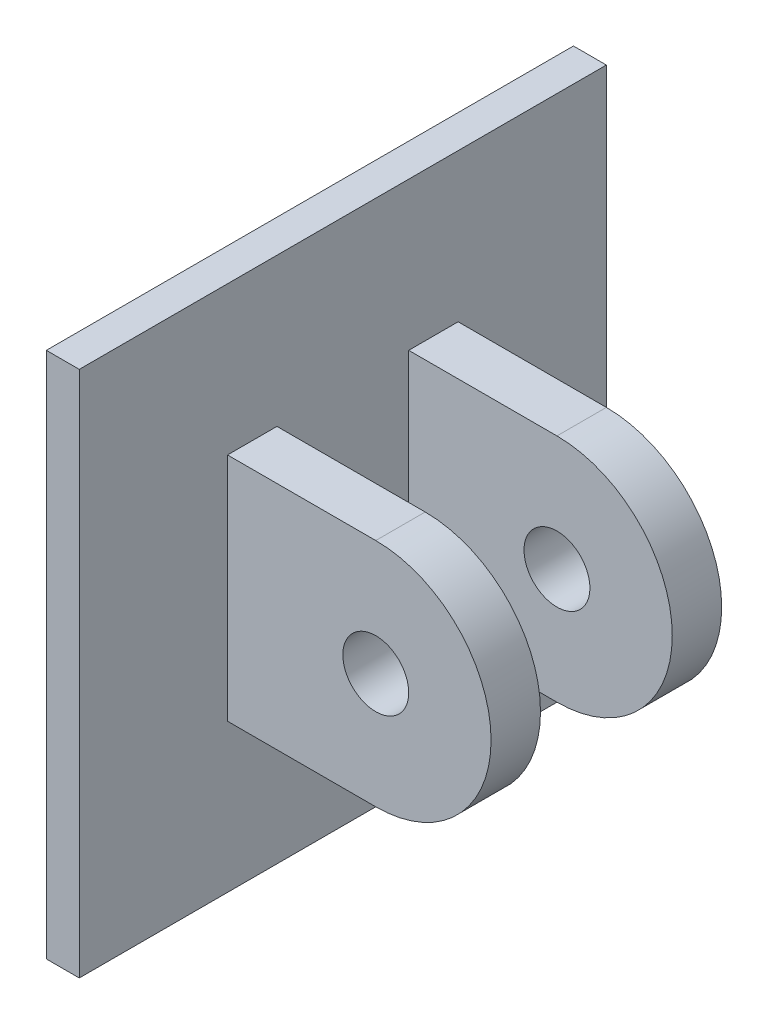
ISO-10303-21;
HEADER;
FILE_DESCRIPTION(('STEP AP214'),'2;1');
FILE_NAME('part.step','',(''),(''),'','','');
FILE_SCHEMA(('AUTOMOTIVE_DESIGN { 1 0 10303 214 1 1 1 1 }'));
ENDSEC;
DATA;
#1=APPLICATION_CONTEXT('core data for automotive mechanical design processes');
#2=APPLICATION_PROTOCOL_DEFINITION('international standard','automotive_design',2000,#1);
#3=PRODUCT_CONTEXT('',#1,'mechanical');
#4=PRODUCT('Part','Part','',(#3));
#5=PRODUCT_RELATED_PRODUCT_CATEGORY('part','',(#4));
#6=PRODUCT_DEFINITION_FORMATION('','',#4);
#7=PRODUCT_DEFINITION_CONTEXT('part definition',#1,'design');
#8=PRODUCT_DEFINITION('design','',#6,#7);
#9=PRODUCT_DEFINITION_SHAPE('','',#8);
#10=(LENGTH_UNIT() NAMED_UNIT(*) SI_UNIT(.MILLI.,.METRE.));
#11=(NAMED_UNIT(*) PLANE_ANGLE_UNIT() SI_UNIT($,.RADIAN.));
#12=(NAMED_UNIT(*) SI_UNIT($,.STERADIAN.) SOLID_ANGLE_UNIT());
#13=UNCERTAINTY_MEASURE_WITH_UNIT(LENGTH_MEASURE(1.E-05),#10,'distance_accuracy_value','');
#14=(GEOMETRIC_REPRESENTATION_CONTEXT(3) GLOBAL_UNCERTAINTY_ASSIGNED_CONTEXT((#13)) GLOBAL_UNIT_ASSIGNED_CONTEXT((#10,
#11,#12)) REPRESENTATION_CONTEXT('',''));
#15=CARTESIAN_POINT('',(0.,0.,0.));
#16=DIRECTION('',(0.,0.,1.));
#17=DIRECTION('',(1.,0.,0.));
#18=AXIS2_PLACEMENT_3D('',#15,#16,#17);
#19=CARTESIAN_POINT('',(57.15,22.225,-12.7));
#20=DIRECTION('',(0.,0.,-1.));
#21=DIRECTION('',(0.,1.,0.));
#22=AXIS2_PLACEMENT_3D('',#19,#20,#21);
#23=PLANE('',#22);
#24=CARTESIAN_POINT('',(34.925,0.,-12.7));
#25=DIRECTION('',(0.,0.,-1.));
#26=DIRECTION('',(0.,1.,0.));
#27=AXIS2_PLACEMENT_3D('',#24,#25,#26);
#28=CIRCLE('',#27,6.35);
#29=CARTESIAN_POINT('',(34.925,6.35,-12.7));
#30=VERTEX_POINT('',#29);
#31=EDGE_CURVE('E185',#30,#30,#28,.T.);
#32=ORIENTED_EDGE('',*,*,#31,.T.);
#33=EDGE_LOOP('',(#32));
#34=FACE_BOUND('',#33,.T.);
#35=DIRECTION('',(-1.,0.,0.));
#36=VECTOR('',#35,1.);
#37=CARTESIAN_POINT('',(57.15,-22.225,-12.7));
#38=LINE('',#37,#36);
#39=CARTESIAN_POINT('',(34.925,-22.225,-12.7));
#40=VERTEX_POINT('',#39);
#41=CARTESIAN_POINT('',(6.35,-22.225,-12.7));
#42=VERTEX_POINT('',#41);
#43=EDGE_CURVE('E191',#40,#42,#38,.T.);
#44=ORIENTED_EDGE('',*,*,#43,.F.);
#45=CARTESIAN_POINT('',(34.925,0.,-12.7));
#46=DIRECTION('',(0.,0.,-1.));
#47=DIRECTION('',(0.,1.,0.));
#48=AXIS2_PLACEMENT_3D('',#45,#46,#47);
#49=CIRCLE('',#48,22.225);
#50=CARTESIAN_POINT('',(34.925,22.225,-12.7));
#51=VERTEX_POINT('',#50);
#52=EDGE_CURVE('E182',#51,#40,#49,.T.);
#53=ORIENTED_EDGE('',*,*,#52,.F.);
#54=DIRECTION('',(-1.,0.,0.));
#55=VECTOR('',#54,1.);
#56=CARTESIAN_POINT('',(57.15,22.225,-12.7));
#57=LINE('',#56,#55);
#58=CARTESIAN_POINT('',(6.35,22.225,-12.7));
#59=VERTEX_POINT('',#58);
#60=EDGE_CURVE('E193',#51,#59,#57,.T.);
#61=ORIENTED_EDGE('',*,*,#60,.T.);
#62=DIRECTION('',(0.,-1.,0.));
#63=VECTOR('',#62,1.);
#64=CARTESIAN_POINT('',(6.35,22.225,-12.7));
#65=LINE('',#64,#63);
#66=EDGE_CURVE('E282',#59,#42,#65,.T.);
#67=ORIENTED_EDGE('',*,*,#66,.T.);
#68=EDGE_LOOP('',(#44,#53,#61,#67));
#69=FACE_BOUND('',#68,.T.);
#70=ADVANCED_FACE('F74',(#34,#69),#23,.F.);
#71=CARTESIAN_POINT('',(57.15,22.225,-22.225));
#72=DIRECTION('',(0.,0.,1.));
#73=DIRECTION('',(0.,-1.,0.));
#74=AXIS2_PLACEMENT_3D('',#71,#72,#73);
#75=PLANE('',#74);
#76=CARTESIAN_POINT('',(34.925,0.,-22.225));
#77=DIRECTION('',(0.,0.,-1.));
#78=DIRECTION('',(0.,1.,0.));
#79=AXIS2_PLACEMENT_3D('',#76,#77,#78);
#80=CIRCLE('',#79,6.35);
#81=CARTESIAN_POINT('',(34.925,6.35000000000001,-22.225));
#82=VERTEX_POINT('',#81);
#83=EDGE_CURVE('E459',#82,#82,#80,.T.);
#84=ORIENTED_EDGE('',*,*,#83,.F.);
#85=EDGE_LOOP('',(#84));
#86=FACE_BOUND('',#85,.T.);
#87=CARTESIAN_POINT('',(34.925,0.,-22.225));
#88=DIRECTION('',(0.,0.,-1.));
#89=DIRECTION('',(0.,1.,0.));
#90=AXIS2_PLACEMENT_3D('',#87,#88,#89);
#91=CIRCLE('',#90,22.225);
#92=CARTESIAN_POINT('',(34.925,22.225,-22.225));
#93=VERTEX_POINT('',#92);
#94=CARTESIAN_POINT('',(34.925,-22.225,-22.225));
#95=VERTEX_POINT('',#94);
#96=EDGE_CURVE('E166',#93,#95,#91,.T.);
#97=ORIENTED_EDGE('',*,*,#96,.T.);
#98=DIRECTION('',(-1.,0.,0.));
#99=VECTOR('',#98,1.);
#100=CARTESIAN_POINT('',(57.15,-22.225,-22.225));
#101=LINE('',#100,#99);
#102=CARTESIAN_POINT('',(6.35,-22.225,-22.225));
#103=VERTEX_POINT('',#102);
#104=EDGE_CURVE('E171',#95,#103,#101,.T.);
#105=ORIENTED_EDGE('',*,*,#104,.T.);
#106=DIRECTION('',(0.,1.,0.));
#107=VECTOR('',#106,1.);
#108=CARTESIAN_POINT('',(6.35,22.225,-22.225));
#109=LINE('',#108,#107);
#110=CARTESIAN_POINT('',(6.35,22.225,-22.225));
#111=VERTEX_POINT('',#110);
#112=EDGE_CURVE('E195',#103,#111,#109,.T.);
#113=ORIENTED_EDGE('',*,*,#112,.T.);
#114=DIRECTION('',(-1.,0.,0.));
#115=VECTOR('',#114,1.);
#116=CARTESIAN_POINT('',(57.15,22.225,-22.225));
#117=LINE('',#116,#115);
#118=EDGE_CURVE('E173',#93,#111,#117,.T.);
#119=ORIENTED_EDGE('',*,*,#118,.F.);
#120=EDGE_LOOP('',(#97,#105,#113,#119));
#121=FACE_BOUND('',#120,.T.);
#122=ADVANCED_FACE('F168',(#86,#121),#75,.F.);
#123=CARTESIAN_POINT('',(57.15,22.225,12.7));
#124=DIRECTION('',(0.,0.,1.));
#125=DIRECTION('',(1.,0.,0.));
#126=AXIS2_PLACEMENT_3D('',#123,#124,#125);
#127=PLANE('',#126);
#128=CARTESIAN_POINT('',(34.925,0.,12.7));
#129=DIRECTION('',(0.,0.,1.));
#130=DIRECTION('',(1.,0.,0.));
#131=AXIS2_PLACEMENT_3D('',#128,#129,#130);
#132=CIRCLE('',#131,6.35);
#133=CARTESIAN_POINT('',(41.275,0.,12.7));
#134=VERTEX_POINT('',#133);
#135=EDGE_CURVE('E458',#134,#134,#132,.T.);
#136=ORIENTED_EDGE('',*,*,#135,.T.);
#137=EDGE_LOOP('',(#136));
#138=FACE_BOUND('',#137,.T.);
#139=CARTESIAN_POINT('',(34.925,0.,12.7));
#140=DIRECTION('',(0.,0.,1.));
#141=DIRECTION('',(1.,0.,0.));
#142=AXIS2_PLACEMENT_3D('',#139,#140,#141);
#143=CIRCLE('',#142,22.225);
#144=CARTESIAN_POINT('',(34.925,-22.225,12.7));
#145=VERTEX_POINT('',#144);
#146=CARTESIAN_POINT('',(34.925,22.225,12.7));
#147=VERTEX_POINT('',#146);
#148=EDGE_CURVE('E295',#145,#147,#143,.T.);
#149=ORIENTED_EDGE('',*,*,#148,.F.);
#150=DIRECTION('',(-1.,0.,0.));
#151=VECTOR('',#150,1.);
#152=CARTESIAN_POINT('',(57.15,-22.225,12.7));
#153=LINE('',#152,#151);
#154=CARTESIAN_POINT('',(6.35,-22.225,12.7));
#155=VERTEX_POINT('',#154);
#156=EDGE_CURVE('E90',#145,#155,#153,.T.);
#157=ORIENTED_EDGE('',*,*,#156,.T.);
#158=DIRECTION('',(0.,1.,0.));
#159=VECTOR('',#158,1.);
#160=CARTESIAN_POINT('',(6.35,22.225,12.7));
#161=LINE('',#160,#159);
#162=CARTESIAN_POINT('',(6.35,22.225,12.7));
#163=VERTEX_POINT('',#162);
#164=EDGE_CURVE('E260',#155,#163,#161,.T.);
#165=ORIENTED_EDGE('',*,*,#164,.T.);
#166=DIRECTION('',(-1.,0.,0.));
#167=VECTOR('',#166,1.);
#168=CARTESIAN_POINT('',(57.15,22.225,12.7));
#169=LINE('',#168,#167);
#170=EDGE_CURVE('E98',#147,#163,#169,.T.);
#171=ORIENTED_EDGE('',*,*,#170,.F.);
#172=EDGE_LOOP('',(#149,#157,#165,#171));
#173=FACE_BOUND('',#172,.T.);
#174=ADVANCED_FACE('F297',(#138,#173),#127,.F.);
#175=CARTESIAN_POINT('',(57.15,22.225,22.225));
#176=DIRECTION('',(0.,0.,-1.));
#177=DIRECTION('',(-1.,0.,0.));
#178=AXIS2_PLACEMENT_3D('',#175,#176,#177);
#179=PLANE('',#178);
#180=CARTESIAN_POINT('',(34.925,0.,22.225));
#181=DIRECTION('',(0.,0.,-1.));
#182=DIRECTION('',(-1.,0.,0.));
#183=AXIS2_PLACEMENT_3D('',#180,#181,#182);
#184=CIRCLE('',#183,6.35);
#185=CARTESIAN_POINT('',(28.575,0.,22.225));
#186=VERTEX_POINT('',#185);
#187=EDGE_CURVE('E78',#186,#186,#184,.T.);
#188=ORIENTED_EDGE('',*,*,#187,.T.);
#189=EDGE_LOOP('',(#188));
#190=FACE_BOUND('',#189,.T.);
#191=DIRECTION('',(-1.,0.,0.));
#192=VECTOR('',#191,1.);
#193=CARTESIAN_POINT('',(57.15,-22.225,22.225));
#194=LINE('',#193,#192);
#195=CARTESIAN_POINT('',(34.925,-22.225,22.225));
#196=VERTEX_POINT('',#195);
#197=CARTESIAN_POINT('',(6.35,-22.225,22.225));
#198=VERTEX_POINT('',#197);
#199=EDGE_CURVE('E267',#196,#198,#194,.T.);
#200=ORIENTED_EDGE('',*,*,#199,.F.);
#201=CARTESIAN_POINT('',(34.925,0.,22.225));
#202=DIRECTION('',(0.,0.,-1.));
#203=DIRECTION('',(-1.,0.,0.));
#204=AXIS2_PLACEMENT_3D('',#201,#202,#203);
#205=CIRCLE('',#204,22.225);
#206=CARTESIAN_POINT('',(34.925,22.225,22.225));
#207=VERTEX_POINT('',#206);
#208=EDGE_CURVE('E292',#207,#196,#205,.T.);
#209=ORIENTED_EDGE('',*,*,#208,.F.);
#210=DIRECTION('',(-1.,0.,0.));
#211=VECTOR('',#210,1.);
#212=CARTESIAN_POINT('',(57.15,22.225,22.225));
#213=LINE('',#212,#211);
#214=CARTESIAN_POINT('',(6.35,22.225,22.225));
#215=VERTEX_POINT('',#214);
#216=EDGE_CURVE('E269',#207,#215,#213,.T.);
#217=ORIENTED_EDGE('',*,*,#216,.T.);
#218=DIRECTION('',(0.,-1.,0.));
#219=VECTOR('',#218,1.);
#220=CARTESIAN_POINT('',(6.35,22.225,22.225));
#221=LINE('',#220,#219);
#222=EDGE_CURVE('E259',#215,#198,#221,.T.);
#223=ORIENTED_EDGE('',*,*,#222,.T.);
#224=EDGE_LOOP('',(#200,#209,#217,#223));
#225=FACE_BOUND('',#224,.T.);
#226=ADVANCED_FACE('F265',(#190,#225),#179,.F.);
#227=CARTESIAN_POINT('',(57.15,-22.225,-22.225));
#228=DIRECTION('',(0.,1.,0.));
#229=DIRECTION('',(0.,0.,1.));
#230=AXIS2_PLACEMENT_3D('',#227,#228,#229);
#231=PLANE('',#230);
#232=DIRECTION('',(0.,0.,-1.));
#233=VECTOR('',#232,1.);
#234=CARTESIAN_POINT('',(34.925,-22.225,50.8));
#235=LINE('',#234,#233);
#236=EDGE_CURVE('E177',#40,#95,#235,.T.);
#237=ORIENTED_EDGE('',*,*,#236,.F.);
#238=ORIENTED_EDGE('',*,*,#43,.T.);
#239=DIRECTION('',(0.,0.,-1.));
#240=VECTOR('',#239,1.);
#241=CARTESIAN_POINT('',(6.35,-22.225,-22.225));
#242=LINE('',#241,#240);
#243=EDGE_CURVE('E190',#42,#103,#242,.T.);
#244=ORIENTED_EDGE('',*,*,#243,.T.);
#245=ORIENTED_EDGE('',*,*,#104,.F.);
#246=EDGE_LOOP('',(#237,#238,#244,#245));
#247=FACE_BOUND('',#246,.T.);
#248=ADVANCED_FACE('F188',(#247),#231,.F.);
#249=CARTESIAN_POINT('',(57.15,-22.225,22.225));
#250=DIRECTION('',(0.,1.,0.));
#251=DIRECTION('',(-1.,0.,0.));
#252=AXIS2_PLACEMENT_3D('',#249,#250,#251);
#253=PLANE('',#252);
#254=DIRECTION('',(0.,0.,-1.));
#255=VECTOR('',#254,1.);
#256=CARTESIAN_POINT('',(34.925,-22.225,50.8));
#257=LINE('',#256,#255);
#258=EDGE_CURVE('E12',#196,#145,#257,.T.);
#259=ORIENTED_EDGE('',*,*,#258,.F.);
#260=ORIENTED_EDGE('',*,*,#199,.T.);
#261=DIRECTION('',(0.,0.,-1.));
#262=VECTOR('',#261,1.);
#263=CARTESIAN_POINT('',(6.35,-22.225,22.225));
#264=LINE('',#263,#262);
#265=EDGE_CURVE('E257',#198,#155,#264,.T.);
#266=ORIENTED_EDGE('',*,*,#265,.T.);
#267=ORIENTED_EDGE('',*,*,#156,.F.);
#268=EDGE_LOOP('',(#259,#260,#266,#267));
#269=FACE_BOUND('',#268,.T.);
#270=ADVANCED_FACE('F251',(#269),#253,.F.);
#271=CARTESIAN_POINT('',(6.35,0.,0.));
#272=DIRECTION('',(-1.,0.,0.));
#273=DIRECTION('',(0.,0.,1.));
#274=AXIS2_PLACEMENT_3D('',#271,#272,#273);
#275=PLANE('',#274);
#276=DIRECTION('',(0.,0.,1.));
#277=VECTOR('',#276,1.);
#278=CARTESIAN_POINT('',(6.35,22.225,-22.225));
#279=LINE('',#278,#277);
#280=EDGE_CURVE('E279',#111,#59,#279,.T.);
#281=ORIENTED_EDGE('',*,*,#280,.F.);
#282=ORIENTED_EDGE('',*,*,#112,.F.);
#283=ORIENTED_EDGE('',*,*,#243,.F.);
#284=ORIENTED_EDGE('',*,*,#66,.F.);
#285=EDGE_LOOP('',(#281,#282,#283,#284));
#286=FACE_BOUND('',#285,.T.);
#287=DIRECTION('',(0.,0.,-1.));
#288=VECTOR('',#287,1.);
#289=CARTESIAN_POINT('',(6.35,50.8,50.8));
#290=LINE('',#289,#288);
#291=CARTESIAN_POINT('',(6.35,50.8,50.8));
#292=VERTEX_POINT('',#291);
#293=CARTESIAN_POINT('',(6.35,50.8,-50.8));
#294=VERTEX_POINT('',#293);
#295=EDGE_CURVE('E201',#292,#294,#290,.T.);
#296=ORIENTED_EDGE('',*,*,#295,.F.);
#297=DIRECTION('',(0.,-1.,0.));
#298=VECTOR('',#297,1.);
#299=CARTESIAN_POINT('',(6.35,50.8,50.8));
#300=LINE('',#299,#298);
#301=CARTESIAN_POINT('',(6.35,-50.8,50.8));
#302=VERTEX_POINT('',#301);
#303=EDGE_CURVE('E210',#292,#302,#300,.T.);
#304=ORIENTED_EDGE('',*,*,#303,.T.);
#305=DIRECTION('',(0.,0.,-1.));
#306=VECTOR('',#305,1.);
#307=CARTESIAN_POINT('',(6.35,-50.8,50.8));
#308=LINE('',#307,#306);
#309=CARTESIAN_POINT('',(6.35,-50.8,-50.8));
#310=VERTEX_POINT('',#309);
#311=EDGE_CURVE('E208',#302,#310,#308,.T.);
#312=ORIENTED_EDGE('',*,*,#311,.T.);
#313=DIRECTION('',(0.,-1.,0.));
#314=VECTOR('',#313,1.);
#315=CARTESIAN_POINT('',(6.35,50.8,-50.8));
#316=LINE('',#315,#314);
#317=EDGE_CURVE('E204',#294,#310,#316,.T.);
#318=ORIENTED_EDGE('',*,*,#317,.F.);
#319=EDGE_LOOP('',(#296,#304,#312,#318));
#320=FACE_BOUND('',#319,.T.);
#321=ORIENTED_EDGE('',*,*,#265,.F.);
#322=ORIENTED_EDGE('',*,*,#222,.F.);
#323=DIRECTION('',(0.,0.,1.));
#324=VECTOR('',#323,1.);
#325=CARTESIAN_POINT('',(6.35,22.225,22.225));
#326=LINE('',#325,#324);
#327=EDGE_CURVE('E270',#163,#215,#326,.T.);
#328=ORIENTED_EDGE('',*,*,#327,.F.);
#329=ORIENTED_EDGE('',*,*,#164,.F.);
#330=EDGE_LOOP('',(#321,#322,#328,#329));
#331=FACE_BOUND('',#330,.T.);
#332=ADVANCED_FACE('F248',(#286,#320,#331),#275,.F.);
#333=CARTESIAN_POINT('',(6.35,50.8,50.8));
#334=DIRECTION('',(0.,1.,0.));
#335=DIRECTION('',(0.,0.,1.));
#336=AXIS2_PLACEMENT_3D('',#333,#334,#335);
#337=PLANE('',#336);
#338=DIRECTION('',(0.,0.,-1.));
#339=VECTOR('',#338,1.);
#340=CARTESIAN_POINT('',(0.,50.8,50.8));
#341=LINE('',#340,#339);
#342=CARTESIAN_POINT('',(0.,50.8,50.8));
#343=VERTEX_POINT('',#342);
#344=CARTESIAN_POINT('',(0.,50.8,-50.8));
#345=VERTEX_POINT('',#344);
#346=EDGE_CURVE('E200',#343,#345,#341,.T.);
#347=ORIENTED_EDGE('',*,*,#346,.F.);
#348=DIRECTION('',(-1.,0.,0.));
#349=VECTOR('',#348,1.);
#350=CARTESIAN_POINT('',(6.35,50.8,50.8));
#351=LINE('',#350,#349);
#352=EDGE_CURVE('E83',#292,#343,#351,.T.);
#353=ORIENTED_EDGE('',*,*,#352,.F.);
#354=ORIENTED_EDGE('',*,*,#295,.T.);
#355=DIRECTION('',(-1.,0.,0.));
#356=VECTOR('',#355,1.);
#357=CARTESIAN_POINT('',(6.35,50.8,-50.8));
#358=LINE('',#357,#356);
#359=EDGE_CURVE('E212',#294,#345,#358,.T.);
#360=ORIENTED_EDGE('',*,*,#359,.T.);
#361=EDGE_LOOP('',(#347,#353,#354,#360));
#362=FACE_BOUND('',#361,.T.);
#363=ADVANCED_FACE('F76',(#362),#337,.T.);
#364=CARTESIAN_POINT('',(6.35,50.8,50.8));
#365=DIRECTION('',(0.,0.,-1.));
#366=DIRECTION('',(0.,1.,0.));
#367=AXIS2_PLACEMENT_3D('',#364,#365,#366);
#368=PLANE('',#367);
#369=DIRECTION('',(0.,-1.,0.));
#370=VECTOR('',#369,1.);
#371=CARTESIAN_POINT('',(0.,50.8,50.8));
#372=LINE('',#371,#370);
#373=CARTESIAN_POINT('',(0.,-50.8,50.8));
#374=VERTEX_POINT('',#373);
#375=EDGE_CURVE('E205',#343,#374,#372,.T.);
#376=ORIENTED_EDGE('',*,*,#375,.T.);
#377=DIRECTION('',(-1.,0.,0.));
#378=VECTOR('',#377,1.);
#379=CARTESIAN_POINT('',(6.35,-50.8,50.8));
#380=LINE('',#379,#378);
#381=EDGE_CURVE('E223',#302,#374,#380,.T.);
#382=ORIENTED_EDGE('',*,*,#381,.F.);
#383=ORIENTED_EDGE('',*,*,#303,.F.);
#384=ORIENTED_EDGE('',*,*,#352,.T.);
#385=EDGE_LOOP('',(#376,#382,#383,#384));
#386=FACE_BOUND('',#385,.T.);
#387=ADVANCED_FACE('F242',(#386),#368,.F.);
#388=CARTESIAN_POINT('',(6.35,-50.8,50.8));
#389=DIRECTION('',(0.,1.,0.));
#390=DIRECTION('',(0.,0.,1.));
#391=AXIS2_PLACEMENT_3D('',#388,#389,#390);
#392=PLANE('',#391);
#393=DIRECTION('',(0.,0.,-1.));
#394=VECTOR('',#393,1.);
#395=CARTESIAN_POINT('',(0.,-50.8,50.8));
#396=LINE('',#395,#394);
#397=CARTESIAN_POINT('',(0.,-50.8,-50.8));
#398=VERTEX_POINT('',#397);
#399=EDGE_CURVE('E218',#374,#398,#396,.T.);
#400=ORIENTED_EDGE('',*,*,#399,.T.);
#401=DIRECTION('',(-1.,0.,0.));
#402=VECTOR('',#401,1.);
#403=CARTESIAN_POINT('',(6.35,-50.8,-50.8));
#404=LINE('',#403,#402);
#405=EDGE_CURVE('E226',#310,#398,#404,.T.);
#406=ORIENTED_EDGE('',*,*,#405,.F.);
#407=ORIENTED_EDGE('',*,*,#311,.F.);
#408=ORIENTED_EDGE('',*,*,#381,.T.);
#409=EDGE_LOOP('',(#400,#406,#407,#408));
#410=FACE_BOUND('',#409,.T.);
#411=ADVANCED_FACE('F246',(#410),#392,.F.);
#412=CARTESIAN_POINT('',(6.35,50.8,-50.8));
#413=DIRECTION('',(0.,0.,-1.));
#414=DIRECTION('',(-1.,0.,0.));
#415=AXIS2_PLACEMENT_3D('',#412,#413,#414);
#416=PLANE('',#415);
#417=DIRECTION('',(0.,-1.,0.));
#418=VECTOR('',#417,1.);
#419=CARTESIAN_POINT('',(0.,50.8,-50.8));
#420=LINE('',#419,#418);
#421=EDGE_CURVE('E215',#345,#398,#420,.T.);
#422=ORIENTED_EDGE('',*,*,#421,.F.);
#423=ORIENTED_EDGE('',*,*,#359,.F.);
#424=ORIENTED_EDGE('',*,*,#317,.T.);
#425=ORIENTED_EDGE('',*,*,#405,.T.);
#426=EDGE_LOOP('',(#422,#423,#424,#425));
#427=FACE_BOUND('',#426,.T.);
#428=ADVANCED_FACE('F234',(#427),#416,.T.);
#429=CARTESIAN_POINT('',(0.,0.,0.));
#430=DIRECTION('',(-1.,0.,0.));
#431=DIRECTION('',(0.,0.,1.));
#432=AXIS2_PLACEMENT_3D('',#429,#430,#431);
#433=PLANE('',#432);
#434=ORIENTED_EDGE('',*,*,#346,.T.);
#435=ORIENTED_EDGE('',*,*,#421,.T.);
#436=ORIENTED_EDGE('',*,*,#399,.F.);
#437=ORIENTED_EDGE('',*,*,#375,.F.);
#438=EDGE_LOOP('',(#434,#435,#436,#437));
#439=FACE_BOUND('',#438,.T.);
#440=ADVANCED_FACE('F239',(#439),#433,.T.);
#441=CARTESIAN_POINT('',(57.15,22.225,-22.225));
#442=DIRECTION('',(0.,-1.,0.));
#443=DIRECTION('',(0.,0.,-1.));
#444=AXIS2_PLACEMENT_3D('',#441,#442,#443);
#445=PLANE('',#444);
#446=ORIENTED_EDGE('',*,*,#60,.F.);
#447=DIRECTION('',(0.,0.,-1.));
#448=VECTOR('',#447,1.);
#449=CARTESIAN_POINT('',(34.925,22.225,50.8));
#450=LINE('',#449,#448);
#451=EDGE_CURVE('E176',#51,#93,#450,.T.);
#452=ORIENTED_EDGE('',*,*,#451,.T.);
#453=ORIENTED_EDGE('',*,*,#118,.T.);
#454=ORIENTED_EDGE('',*,*,#280,.T.);
#455=EDGE_LOOP('',(#446,#452,#453,#454));
#456=FACE_BOUND('',#455,.T.);
#457=ADVANCED_FACE('F289',(#456),#445,.F.);
#458=CARTESIAN_POINT('',(57.15,22.225,22.225));
#459=DIRECTION('',(0.,-1.,0.));
#460=DIRECTION('',(1.,0.,0.));
#461=AXIS2_PLACEMENT_3D('',#458,#459,#460);
#462=PLANE('',#461);
#463=ORIENTED_EDGE('',*,*,#216,.F.);
#464=EDGE_CURVE('E290',#207,#147,#450,.T.);
#465=ORIENTED_EDGE('',*,*,#464,.T.);
#466=ORIENTED_EDGE('',*,*,#170,.T.);
#467=ORIENTED_EDGE('',*,*,#327,.T.);
#468=EDGE_LOOP('',(#463,#465,#466,#467));
#469=FACE_BOUND('',#468,.T.);
#470=ADVANCED_FACE('F320',(#469),#462,.F.);
#471=CARTESIAN_POINT('',(34.925,0.,50.8));
#472=DIRECTION('',(0.,0.,-1.));
#473=DIRECTION('',(0.,1.,0.));
#474=AXIS2_PLACEMENT_3D('',#471,#472,#473);
#475=CYLINDRICAL_SURFACE('',#474,22.225);
#476=ORIENTED_EDGE('',*,*,#148,.T.);
#477=ORIENTED_EDGE('',*,*,#464,.F.);
#478=ORIENTED_EDGE('',*,*,#208,.T.);
#479=ORIENTED_EDGE('',*,*,#258,.T.);
#480=EDGE_LOOP('',(#476,#477,#478,#479));
#481=FACE_BOUND('',#480,.T.);
#482=ADVANCED_FACE('F300',(#481),#475,.T.);
#483=ORIENTED_EDGE('',*,*,#52,.T.);
#484=ORIENTED_EDGE('',*,*,#236,.T.);
#485=ORIENTED_EDGE('',*,*,#96,.F.);
#486=ORIENTED_EDGE('',*,*,#451,.F.);
#487=EDGE_LOOP('',(#483,#484,#485,#486));
#488=FACE_BOUND('',#487,.T.);
#489=ADVANCED_FACE('F180',(#488),#475,.T.);
#490=CARTESIAN_POINT('',(34.925,0.,50.8));
#491=DIRECTION('',(0.,0.,-1.));
#492=DIRECTION('',(0.,1.,0.));
#493=AXIS2_PLACEMENT_3D('',#490,#491,#492);
#494=CYLINDRICAL_SURFACE('',#493,6.35);
#495=ORIENTED_EDGE('',*,*,#187,.F.);
#496=EDGE_LOOP('',(#495));
#497=FACE_BOUND('',#496,.T.);
#498=ORIENTED_EDGE('',*,*,#135,.F.);
#499=EDGE_LOOP('',(#498));
#500=FACE_BOUND('',#499,.T.);
#501=ADVANCED_FACE('F359',(#497,#500),#494,.F.);
#502=ORIENTED_EDGE('',*,*,#83,.T.);
#503=EDGE_LOOP('',(#502));
#504=FACE_BOUND('',#503,.T.);
#505=ORIENTED_EDGE('',*,*,#31,.F.);
#506=EDGE_LOOP('',(#505));
#507=FACE_BOUND('',#506,.T.);
#508=ADVANCED_FACE('F365',(#504,#507),#494,.F.);
#509=CLOSED_SHELL('',(#70,#122,#174,#226,#248,#270,#332,#363,#387,#411,#428,#440,#457,#470,#482,
#489,#501,#508));
#510=MANIFOLD_SOLID_BREP('B2',#509);
#511=ADVANCED_BREP_SHAPE_REPRESENTATION('',(#18,#510),#14);
#512=SHAPE_DEFINITION_REPRESENTATION(#9,#511);
ENDSEC;
END-ISO-10303-21;
